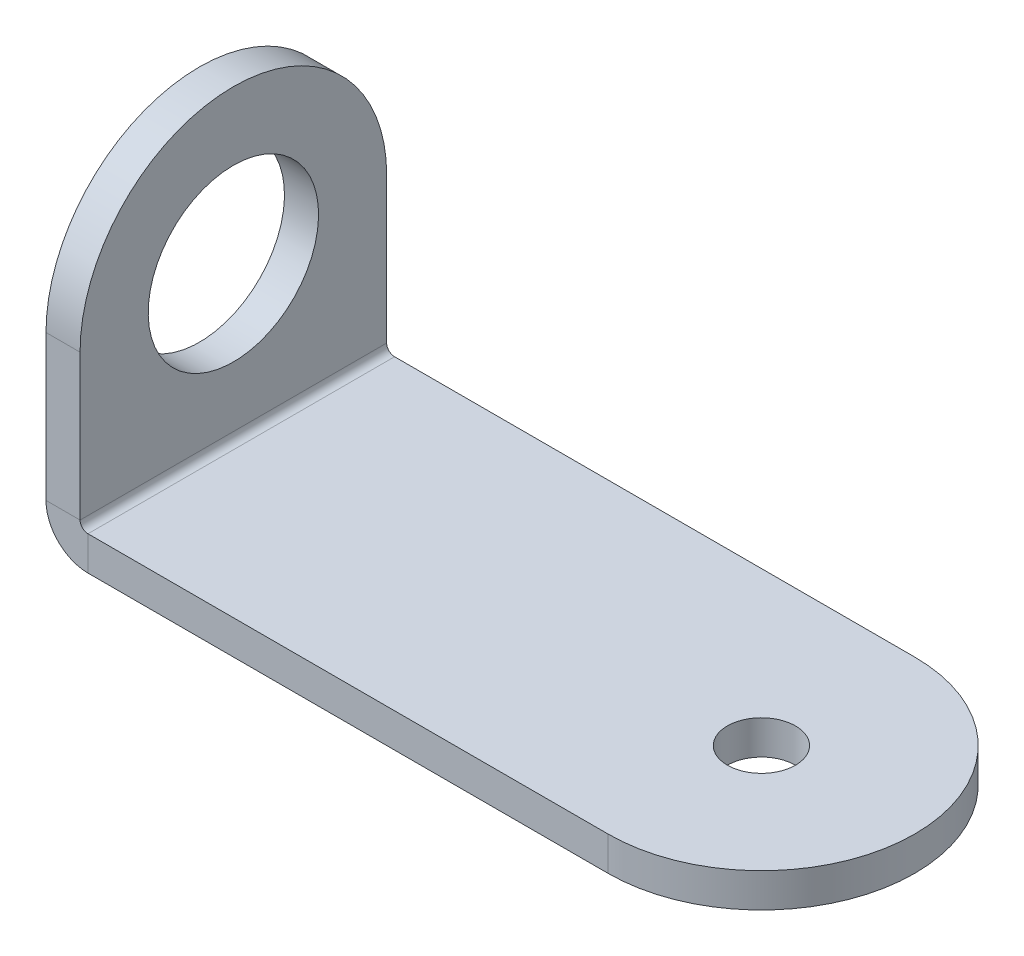
ISO-10303-21;
HEADER;
FILE_DESCRIPTION(('STEP AP214'),'2;1');
FILE_NAME('part.step','',(''),(''),'','','');
FILE_SCHEMA(('AUTOMOTIVE_DESIGN { 1 0 10303 214 1 1 1 1 }'));
ENDSEC;
DATA;
#1=APPLICATION_CONTEXT('core data for automotive mechanical design processes');
#2=APPLICATION_PROTOCOL_DEFINITION('international standard','automotive_design',2000,#1);
#3=PRODUCT_CONTEXT('',#1,'mechanical');
#4=PRODUCT('Part','Part','',(#3));
#5=PRODUCT_RELATED_PRODUCT_CATEGORY('part','',(#4));
#6=PRODUCT_DEFINITION_FORMATION('','',#4);
#7=PRODUCT_DEFINITION_CONTEXT('part definition',#1,'design');
#8=PRODUCT_DEFINITION('design','',#6,#7);
#9=PRODUCT_DEFINITION_SHAPE('','',#8);
#10=(LENGTH_UNIT() NAMED_UNIT(*) SI_UNIT(.MILLI.,.METRE.));
#11=(NAMED_UNIT(*) PLANE_ANGLE_UNIT() SI_UNIT($,.RADIAN.));
#12=(NAMED_UNIT(*) SI_UNIT($,.STERADIAN.) SOLID_ANGLE_UNIT());
#13=UNCERTAINTY_MEASURE_WITH_UNIT(LENGTH_MEASURE(1.E-05),#10,'distance_accuracy_value','');
#14=(GEOMETRIC_REPRESENTATION_CONTEXT(3) GLOBAL_UNCERTAINTY_ASSIGNED_CONTEXT((#13)) GLOBAL_UNIT_ASSIGNED_CONTEXT((#10,
#11,#12)) REPRESENTATION_CONTEXT('',''));
#15=CARTESIAN_POINT('',(0.,0.,0.));
#16=DIRECTION('',(0.,0.,1.));
#17=DIRECTION('',(1.,0.,0.));
#18=AXIS2_PLACEMENT_3D('',#15,#16,#17);
#19=CARTESIAN_POINT('',(0.,14.2875,0.));
#20=DIRECTION('',(1.,0.,0.));
#21=DIRECTION('',(0.,0.,-1.));
#22=AXIS2_PLACEMENT_3D('',#19,#20,#21);
#23=CYLINDRICAL_SURFACE('',#22,14.2875);
#24=DIRECTION('',(-1.,0.,0.));
#25=VECTOR('',#24,1.);
#26=CARTESIAN_POINT('',(0.,14.2875,14.2875));
#27=LINE('',#26,#25);
#28=CARTESIAN_POINT('',(0.,14.2875,14.2875));
#29=VERTEX_POINT('',#28);
#30=CARTESIAN_POINT('',(-3.175,14.2875,14.2875));
#31=VERTEX_POINT('',#30);
#32=EDGE_CURVE('E184',#29,#31,#27,.T.);
#33=ORIENTED_EDGE('',*,*,#32,.F.);
#34=CARTESIAN_POINT('',(0.,14.2875,0.));
#35=DIRECTION('',(1.,0.,0.));
#36=DIRECTION('',(0.,1.,0.));
#37=AXIS2_PLACEMENT_3D('',#34,#35,#36);
#38=CIRCLE('',#37,14.2875);
#39=CARTESIAN_POINT('',(0.,14.2875,-14.2875));
#40=VERTEX_POINT('',#39);
#41=EDGE_CURVE('E49',#40,#29,#38,.T.);
#42=ORIENTED_EDGE('',*,*,#41,.F.);
#43=DIRECTION('',(1.,0.,0.));
#44=VECTOR('',#43,1.);
#45=CARTESIAN_POINT('',(0.7366,14.2875,-14.2875));
#46=LINE('',#45,#44);
#47=CARTESIAN_POINT('',(-3.175,14.2875,-14.2875));
#48=VERTEX_POINT('',#47);
#49=EDGE_CURVE('E187',#48,#40,#46,.T.);
#50=ORIENTED_EDGE('',*,*,#49,.F.);
#51=CARTESIAN_POINT('',(-3.175,14.2875,0.));
#52=DIRECTION('',(1.,0.,0.));
#53=DIRECTION('',(0.,1.,0.));
#54=AXIS2_PLACEMENT_3D('',#51,#52,#53);
#55=CIRCLE('',#54,14.2875);
#56=EDGE_CURVE('E11',#31,#48,#55,.F.);
#57=ORIENTED_EDGE('',*,*,#56,.F.);
#58=EDGE_LOOP('',(#33,#42,#50,#57));
#59=FACE_BOUND('',#58,.T.);
#60=ADVANCED_FACE('F41',(#59),#23,.T.);
#61=CARTESIAN_POINT('',(49.2125,-3.175,0.));
#62=DIRECTION('',(0.,-1.,0.));
#63=DIRECTION('',(0.,0.,-1.));
#64=AXIS2_PLACEMENT_3D('',#61,#62,#63);
#65=CYLINDRICAL_SURFACE('',#64,14.2875);
#66=DIRECTION('',(0.,-1.,0.));
#67=VECTOR('',#66,1.);
#68=CARTESIAN_POINT('',(49.2125,0.736600000000001,14.2875));
#69=LINE('',#68,#67);
#70=CARTESIAN_POINT('',(49.2125,-3.175,14.2875));
#71=VERTEX_POINT('',#70);
#72=CARTESIAN_POINT('',(49.2125,0.,14.2875));
#73=VERTEX_POINT('',#72);
#74=EDGE_CURVE('E115',#71,#73,#69,.F.);
#75=ORIENTED_EDGE('',*,*,#74,.F.);
#76=CARTESIAN_POINT('',(49.2125,-3.175,0.));
#77=DIRECTION('',(0.,1.,0.));
#78=DIRECTION('',(0.,0.,1.));
#79=AXIS2_PLACEMENT_3D('',#76,#77,#78);
#80=CIRCLE('',#79,14.2875);
#81=CARTESIAN_POINT('',(49.2125,-3.175,-14.2875));
#82=VERTEX_POINT('',#81);
#83=EDGE_CURVE('E180',#82,#71,#80,.F.);
#84=ORIENTED_EDGE('',*,*,#83,.F.);
#85=DIRECTION('',(0.,-1.,0.));
#86=VECTOR('',#85,1.);
#87=CARTESIAN_POINT('',(49.2125,0.7366,-14.2875));
#88=LINE('',#87,#86);
#89=CARTESIAN_POINT('',(49.2125,0.,-14.2875));
#90=VERTEX_POINT('',#89);
#91=EDGE_CURVE('E177',#90,#82,#88,.T.);
#92=ORIENTED_EDGE('',*,*,#91,.F.);
#93=CARTESIAN_POINT('',(49.2125,0.,0.));
#94=DIRECTION('',(0.,1.,0.));
#95=DIRECTION('',(0.,0.,1.));
#96=AXIS2_PLACEMENT_3D('',#93,#94,#95);
#97=CIRCLE('',#96,14.2875);
#98=EDGE_CURVE('E182',#73,#90,#97,.T.);
#99=ORIENTED_EDGE('',*,*,#98,.F.);
#100=EDGE_LOOP('',(#75,#84,#92,#99));
#101=FACE_BOUND('',#100,.T.);
#102=ADVANCED_FACE('F235',(#101),#65,.T.);
#103=CARTESIAN_POINT('',(0.7366,0.,14.2875));
#104=DIRECTION('',(0.,0.,1.));
#105=DIRECTION('',(1.,0.,0.));
#106=AXIS2_PLACEMENT_3D('',#103,#104,#105);
#107=PLANE('',#106);
#108=DIRECTION('',(0.,-1.,0.));
#109=VECTOR('',#108,1.);
#110=CARTESIAN_POINT('',(0.7366,0.,14.2875));
#111=LINE('',#110,#109);
#112=CARTESIAN_POINT('',(0.7366,0.,14.2875));
#113=VERTEX_POINT('',#112);
#114=CARTESIAN_POINT('',(0.7366,-3.175,14.2875));
#115=VERTEX_POINT('',#114);
#116=EDGE_CURVE('E103',#113,#115,#111,.T.);
#117=ORIENTED_EDGE('',*,*,#116,.F.);
#118=CARTESIAN_POINT('',(0.7366,0.7366,14.2875));
#119=DIRECTION('',(0.,0.,-1.));
#120=DIRECTION('',(-1.,0.,0.));
#121=AXIS2_PLACEMENT_3D('',#118,#119,#120);
#122=CIRCLE('',#121,0.7366);
#123=CARTESIAN_POINT('',(0.,0.7366,14.2875));
#124=VERTEX_POINT('',#123);
#125=EDGE_CURVE('E108',#124,#113,#122,.F.);
#126=ORIENTED_EDGE('',*,*,#125,.F.);
#127=DIRECTION('',(1.,0.,0.));
#128=VECTOR('',#127,1.);
#129=CARTESIAN_POINT('',(-3.175,0.736600000000001,14.2875));
#130=LINE('',#129,#128);
#131=CARTESIAN_POINT('',(-3.175,0.736600000000001,14.2875));
#132=VERTEX_POINT('',#131);
#133=EDGE_CURVE('E116',#132,#124,#130,.T.);
#134=ORIENTED_EDGE('',*,*,#133,.F.);
#135=CARTESIAN_POINT('',(0.7366,0.7366,14.2875));
#136=DIRECTION('',(0.,0.,1.));
#137=DIRECTION('',(1.,0.,0.));
#138=AXIS2_PLACEMENT_3D('',#135,#136,#137);
#139=CIRCLE('',#138,3.9116);
#140=EDGE_CURVE('E110',#132,#115,#139,.T.);
#141=ORIENTED_EDGE('',*,*,#140,.T.);
#142=EDGE_LOOP('',(#117,#126,#134,#141));
#143=FACE_BOUND('',#142,.T.);
#144=ADVANCED_FACE('F105',(#143),#107,.T.);
#145=CARTESIAN_POINT('',(-3.175,0.736600000000001,14.2875));
#146=DIRECTION('',(0.,0.,1.));
#147=DIRECTION('',(1.,0.,0.));
#148=AXIS2_PLACEMENT_3D('',#145,#146,#147);
#149=PLANE('',#148);
#150=DIRECTION('',(1.,0.,0.));
#151=VECTOR('',#150,1.);
#152=CARTESIAN_POINT('',(0.,-3.175,14.2875));
#153=LINE('',#152,#151);
#154=EDGE_CURVE('E136',#115,#71,#153,.T.);
#155=ORIENTED_EDGE('',*,*,#154,.T.);
#156=ORIENTED_EDGE('',*,*,#74,.T.);
#157=DIRECTION('',(1.,0.,0.));
#158=VECTOR('',#157,1.);
#159=CARTESIAN_POINT('',(0.,0.,14.2875));
#160=LINE('',#159,#158);
#161=EDGE_CURVE('E124',#113,#73,#160,.T.);
#162=ORIENTED_EDGE('',*,*,#161,.F.);
#163=ORIENTED_EDGE('',*,*,#116,.T.);
#164=EDGE_LOOP('',(#155,#156,#162,#163));
#165=FACE_BOUND('',#164,.T.);
#166=ADVANCED_FACE('F134',(#165),#149,.T.);
#167=CARTESIAN_POINT('',(0.,0.7366,-14.2875));
#168=DIRECTION('',(0.,0.,-1.));
#169=DIRECTION('',(-1.,0.,0.));
#170=AXIS2_PLACEMENT_3D('',#167,#168,#169);
#171=PLANE('',#170);
#172=DIRECTION('',(-1.,0.,0.));
#173=VECTOR('',#172,1.);
#174=CARTESIAN_POINT('',(0.,0.7366,-14.2875));
#175=LINE('',#174,#173);
#176=CARTESIAN_POINT('',(0.,0.7366,-14.2875));
#177=VERTEX_POINT('',#176);
#178=CARTESIAN_POINT('',(-3.175,0.736600000000001,-14.2875));
#179=VERTEX_POINT('',#178);
#180=EDGE_CURVE('E171',#177,#179,#175,.T.);
#181=ORIENTED_EDGE('',*,*,#180,.F.);
#182=CARTESIAN_POINT('',(0.7366,0.7366,-14.2875));
#183=DIRECTION('',(0.,0.,-1.));
#184=DIRECTION('',(-1.,0.,0.));
#185=AXIS2_PLACEMENT_3D('',#182,#183,#184);
#186=CIRCLE('',#185,0.7366);
#187=CARTESIAN_POINT('',(0.7366,0.,-14.2875));
#188=VERTEX_POINT('',#187);
#189=EDGE_CURVE('E155',#177,#188,#186,.F.);
#190=ORIENTED_EDGE('',*,*,#189,.T.);
#191=DIRECTION('',(0.,1.,0.));
#192=VECTOR('',#191,1.);
#193=CARTESIAN_POINT('',(0.7366,-3.175,-14.2875));
#194=LINE('',#193,#192);
#195=CARTESIAN_POINT('',(0.7366,-3.175,-14.2875));
#196=VERTEX_POINT('',#195);
#197=EDGE_CURVE('E130',#196,#188,#194,.T.);
#198=ORIENTED_EDGE('',*,*,#197,.F.);
#199=CARTESIAN_POINT('',(0.7366,0.7366,-14.2875));
#200=DIRECTION('',(0.,0.,1.));
#201=DIRECTION('',(1.,0.,0.));
#202=AXIS2_PLACEMENT_3D('',#199,#200,#201);
#203=CIRCLE('',#202,3.9116);
#204=EDGE_CURVE('E161',#179,#196,#203,.T.);
#205=ORIENTED_EDGE('',*,*,#204,.F.);
#206=EDGE_LOOP('',(#181,#190,#198,#205));
#207=FACE_BOUND('',#206,.T.);
#208=ADVANCED_FACE('F250',(#207),#171,.T.);
#209=CARTESIAN_POINT('',(0.7366,-3.175,-14.2875));
#210=DIRECTION('',(0.,0.,-1.));
#211=DIRECTION('',(-1.,0.,0.));
#212=AXIS2_PLACEMENT_3D('',#209,#210,#211);
#213=PLANE('',#212);
#214=DIRECTION('',(0.,-1.,0.));
#215=VECTOR('',#214,1.);
#216=CARTESIAN_POINT('',(-3.175,28.575,-14.2875));
#217=LINE('',#216,#215);
#218=EDGE_CURVE('E159',#48,#179,#217,.T.);
#219=ORIENTED_EDGE('',*,*,#218,.F.);
#220=ORIENTED_EDGE('',*,*,#49,.T.);
#221=DIRECTION('',(0.,-1.,0.));
#222=VECTOR('',#221,1.);
#223=CARTESIAN_POINT('',(0.,28.575,-14.2875));
#224=LINE('',#223,#222);
#225=EDGE_CURVE('E157',#40,#177,#224,.T.);
#226=ORIENTED_EDGE('',*,*,#225,.T.);
#227=ORIENTED_EDGE('',*,*,#180,.T.);
#228=EDGE_LOOP('',(#219,#220,#226,#227));
#229=FACE_BOUND('',#228,.T.);
#230=ADVANCED_FACE('F232',(#229),#213,.T.);
#231=CARTESIAN_POINT('',(0.,-3.175,14.2875));
#232=DIRECTION('',(0.,1.,0.));
#233=DIRECTION('',(0.,0.,1.));
#234=AXIS2_PLACEMENT_3D('',#231,#232,#233);
#235=PLANE('',#234);
#236=CARTESIAN_POINT('',(49.2125,-3.175,0.));
#237=DIRECTION('',(0.,1.,0.));
#238=DIRECTION('',(0.,0.,1.));
#239=AXIS2_PLACEMENT_3D('',#236,#237,#238);
#240=CIRCLE('',#239,3.17499999999999);
#241=CARTESIAN_POINT('',(49.2125,-3.175,3.17499999999999));
#242=VERTEX_POINT('',#241);
#243=EDGE_CURVE('E208',#242,#242,#240,.T.);
#244=ORIENTED_EDGE('',*,*,#243,.T.);
#245=EDGE_LOOP('',(#244));
#246=FACE_BOUND('',#245,.T.);
#247=DIRECTION('',(1.,0.,0.));
#248=VECTOR('',#247,1.);
#249=CARTESIAN_POINT('',(0.,-3.175,-14.2875));
#250=LINE('',#249,#248);
#251=EDGE_CURVE('E150',#196,#82,#250,.T.);
#252=ORIENTED_EDGE('',*,*,#251,.T.);
#253=ORIENTED_EDGE('',*,*,#83,.T.);
#254=ORIENTED_EDGE('',*,*,#154,.F.);
#255=DIRECTION('',(0.,0.,-1.));
#256=VECTOR('',#255,1.);
#257=CARTESIAN_POINT('',(0.7366,-3.175,14.2875));
#258=LINE('',#257,#256);
#259=EDGE_CURVE('E149',#115,#196,#258,.T.);
#260=ORIENTED_EDGE('',*,*,#259,.T.);
#261=EDGE_LOOP('',(#252,#253,#254,#260));
#262=FACE_BOUND('',#261,.T.);
#263=ADVANCED_FACE('F203',(#246,#262),#235,.F.);
#264=CARTESIAN_POINT('',(0.,0.,14.2875));
#265=DIRECTION('',(0.,1.,0.));
#266=DIRECTION('',(0.,0.,1.));
#267=AXIS2_PLACEMENT_3D('',#264,#265,#266);
#268=PLANE('',#267);
#269=CARTESIAN_POINT('',(49.2125,0.,0.));
#270=DIRECTION('',(0.,1.,0.));
#271=DIRECTION('',(0.,0.,1.));
#272=AXIS2_PLACEMENT_3D('',#269,#270,#271);
#273=CIRCLE('',#272,3.17499999999999);
#274=CARTESIAN_POINT('',(49.2125,0.,3.17499999999999));
#275=VERTEX_POINT('',#274);
#276=EDGE_CURVE('E211',#275,#275,#273,.T.);
#277=ORIENTED_EDGE('',*,*,#276,.F.);
#278=EDGE_LOOP('',(#277));
#279=FACE_BOUND('',#278,.T.);
#280=ORIENTED_EDGE('',*,*,#161,.T.);
#281=ORIENTED_EDGE('',*,*,#98,.T.);
#282=DIRECTION('',(1.,0.,0.));
#283=VECTOR('',#282,1.);
#284=CARTESIAN_POINT('',(0.,0.,-14.2875));
#285=LINE('',#284,#283);
#286=EDGE_CURVE('E126',#188,#90,#285,.T.);
#287=ORIENTED_EDGE('',*,*,#286,.F.);
#288=DIRECTION('',(0.,0.,-1.));
#289=VECTOR('',#288,1.);
#290=CARTESIAN_POINT('',(0.7366,0.,14.2875));
#291=LINE('',#290,#289);
#292=EDGE_CURVE('E122',#113,#188,#291,.T.);
#293=ORIENTED_EDGE('',*,*,#292,.F.);
#294=EDGE_LOOP('',(#280,#281,#287,#293));
#295=FACE_BOUND('',#294,.T.);
#296=ADVANCED_FACE('F123',(#279,#295),#268,.T.);
#297=CARTESIAN_POINT('',(0.7366,0.7366,14.2875));
#298=DIRECTION('',(0.,0.,-1.));
#299=DIRECTION('',(-1.,0.,0.));
#300=AXIS2_PLACEMENT_3D('',#297,#298,#299);
#301=CYLINDRICAL_SURFACE('',#300,0.7366);
#302=ORIENTED_EDGE('',*,*,#189,.F.);
#303=DIRECTION('',(0.,0.,-1.));
#304=VECTOR('',#303,1.);
#305=CARTESIAN_POINT('',(0.,0.7366,14.2875));
#306=LINE('',#305,#304);
#307=EDGE_CURVE('E131',#124,#177,#306,.T.);
#308=ORIENTED_EDGE('',*,*,#307,.F.);
#309=ORIENTED_EDGE('',*,*,#125,.T.);
#310=ORIENTED_EDGE('',*,*,#292,.T.);
#311=EDGE_LOOP('',(#302,#308,#309,#310));
#312=FACE_BOUND('',#311,.T.);
#313=ADVANCED_FACE('F139',(#312),#301,.F.);
#314=CARTESIAN_POINT('',(0.,28.575,14.2875));
#315=DIRECTION('',(1.,0.,0.));
#316=DIRECTION('',(0.,1.,0.));
#317=AXIS2_PLACEMENT_3D('',#314,#315,#316);
#318=PLANE('',#317);
#319=CARTESIAN_POINT('',(0.,14.2874999999998,-1.95994734083658E-10));
#320=DIRECTION('',(1.,0.,0.));
#321=DIRECTION('',(0.,1.,0.));
#322=AXIS2_PLACEMENT_3D('',#319,#320,#321);
#323=CIRCLE('',#322,7.9375);
#324=CARTESIAN_POINT('',(0.,22.2249999999998,-1.95994734083658E-10));
#325=VERTEX_POINT('',#324);
#326=EDGE_CURVE('E205',#325,#325,#323,.T.);
#327=ORIENTED_EDGE('',*,*,#326,.F.);
#328=EDGE_LOOP('',(#327));
#329=FACE_BOUND('',#328,.T.);
#330=ORIENTED_EDGE('',*,*,#225,.F.);
#331=ORIENTED_EDGE('',*,*,#41,.T.);
#332=DIRECTION('',(0.,-1.,0.));
#333=VECTOR('',#332,1.);
#334=CARTESIAN_POINT('',(0.,28.575,14.2875));
#335=LINE('',#334,#333);
#336=EDGE_CURVE('E141',#29,#124,#335,.T.);
#337=ORIENTED_EDGE('',*,*,#336,.T.);
#338=ORIENTED_EDGE('',*,*,#307,.T.);
#339=EDGE_LOOP('',(#330,#331,#337,#338));
#340=FACE_BOUND('',#339,.T.);
#341=ADVANCED_FACE('F190',(#329,#340),#318,.T.);
#342=CARTESIAN_POINT('',(-3.175,28.575,14.2875));
#343=DIRECTION('',(1.,0.,0.));
#344=DIRECTION('',(0.,1.,0.));
#345=AXIS2_PLACEMENT_3D('',#342,#343,#344);
#346=PLANE('',#345);
#347=CARTESIAN_POINT('',(-3.175,14.2874999999998,-1.95994734083658E-10));
#348=DIRECTION('',(1.,0.,0.));
#349=DIRECTION('',(0.,1.,0.));
#350=AXIS2_PLACEMENT_3D('',#347,#348,#349);
#351=CIRCLE('',#350,7.9375);
#352=CARTESIAN_POINT('',(-3.175,22.2249999999998,-1.95994734083658E-10));
#353=VERTEX_POINT('',#352);
#354=EDGE_CURVE('E153',#353,#353,#351,.T.);
#355=ORIENTED_EDGE('',*,*,#354,.T.);
#356=EDGE_LOOP('',(#355));
#357=FACE_BOUND('',#356,.T.);
#358=DIRECTION('',(0.,-1.,0.));
#359=VECTOR('',#358,1.);
#360=CARTESIAN_POINT('',(-3.175,28.575,14.2875));
#361=LINE('',#360,#359);
#362=EDGE_CURVE('E143',#31,#132,#361,.T.);
#363=ORIENTED_EDGE('',*,*,#362,.F.);
#364=ORIENTED_EDGE('',*,*,#56,.T.);
#365=ORIENTED_EDGE('',*,*,#218,.T.);
#366=DIRECTION('',(0.,0.,-1.));
#367=VECTOR('',#366,1.);
#368=CARTESIAN_POINT('',(-3.175,0.736600000000001,14.2875));
#369=LINE('',#368,#367);
#370=EDGE_CURVE('E166',#132,#179,#369,.T.);
#371=ORIENTED_EDGE('',*,*,#370,.F.);
#372=EDGE_LOOP('',(#363,#364,#365,#371));
#373=FACE_BOUND('',#372,.T.);
#374=ADVANCED_FACE('F195',(#357,#373),#346,.F.);
#375=CARTESIAN_POINT('',(0.7366,0.7366,14.2875));
#376=DIRECTION('',(0.,0.,-1.));
#377=DIRECTION('',(-1.,0.,0.));
#378=AXIS2_PLACEMENT_3D('',#375,#376,#377);
#379=CYLINDRICAL_SURFACE('',#378,3.9116);
#380=ORIENTED_EDGE('',*,*,#204,.T.);
#381=ORIENTED_EDGE('',*,*,#259,.F.);
#382=ORIENTED_EDGE('',*,*,#140,.F.);
#383=ORIENTED_EDGE('',*,*,#370,.T.);
#384=EDGE_LOOP('',(#380,#381,#382,#383));
#385=FACE_BOUND('',#384,.T.);
#386=ADVANCED_FACE('F199',(#385),#379,.T.);
#387=CARTESIAN_POINT('',(0.7366,0.7366,14.2875));
#388=DIRECTION('',(0.,0.,-1.));
#389=DIRECTION('',(-1.,0.,0.));
#390=AXIS2_PLACEMENT_3D('',#387,#388,#389);
#391=PLANE('',#390);
#392=ORIENTED_EDGE('',*,*,#336,.F.);
#393=ORIENTED_EDGE('',*,*,#32,.T.);
#394=ORIENTED_EDGE('',*,*,#362,.T.);
#395=ORIENTED_EDGE('',*,*,#133,.T.);
#396=EDGE_LOOP('',(#392,#393,#394,#395));
#397=FACE_BOUND('',#396,.T.);
#398=ADVANCED_FACE('F193',(#397),#391,.F.);
#399=CARTESIAN_POINT('',(0.7366,0.7366,-14.2875));
#400=DIRECTION('',(0.,0.,-1.));
#401=DIRECTION('',(-1.,0.,0.));
#402=AXIS2_PLACEMENT_3D('',#399,#400,#401);
#403=PLANE('',#402);
#404=ORIENTED_EDGE('',*,*,#286,.T.);
#405=ORIENTED_EDGE('',*,*,#91,.T.);
#406=ORIENTED_EDGE('',*,*,#251,.F.);
#407=ORIENTED_EDGE('',*,*,#197,.T.);
#408=EDGE_LOOP('',(#404,#405,#406,#407));
#409=FACE_BOUND('',#408,.T.);
#410=ADVANCED_FACE('F260',(#409),#403,.T.);
#411=CARTESIAN_POINT('',(-3.175,14.2874999999998,-1.95994734083658E-10));
#412=DIRECTION('',(1.,0.,0.));
#413=DIRECTION('',(0.,1.,0.));
#414=AXIS2_PLACEMENT_3D('',#411,#412,#413);
#415=CYLINDRICAL_SURFACE('',#414,7.9375);
#416=ORIENTED_EDGE('',*,*,#354,.F.);
#417=EDGE_LOOP('',(#416));
#418=FACE_BOUND('',#417,.T.);
#419=ORIENTED_EDGE('',*,*,#326,.T.);
#420=EDGE_LOOP('',(#419));
#421=FACE_BOUND('',#420,.T.);
#422=ADVANCED_FACE('F221',(#418,#421),#415,.F.);
#423=CARTESIAN_POINT('',(49.2125,-3.175,0.));
#424=DIRECTION('',(0.,1.,0.));
#425=DIRECTION('',(0.,0.,1.));
#426=AXIS2_PLACEMENT_3D('',#423,#424,#425);
#427=CYLINDRICAL_SURFACE('',#426,3.17499999999999);
#428=ORIENTED_EDGE('',*,*,#243,.F.);
#429=EDGE_LOOP('',(#428));
#430=FACE_BOUND('',#429,.T.);
#431=ORIENTED_EDGE('',*,*,#276,.T.);
#432=EDGE_LOOP('',(#431));
#433=FACE_BOUND('',#432,.T.);
#434=ADVANCED_FACE('F218',(#430,#433),#427,.F.);
#435=CLOSED_SHELL('',(#60,#102,#144,#166,#208,#230,#263,#296,#313,#341,#374,#386,#398,#410,#422,#434));
#436=MANIFOLD_SOLID_BREP('B2',#435);
#437=ADVANCED_BREP_SHAPE_REPRESENTATION('',(#18,#436),#14);
#438=SHAPE_DEFINITION_REPRESENTATION(#9,#437);
ENDSEC;
END-ISO-10303-21;
